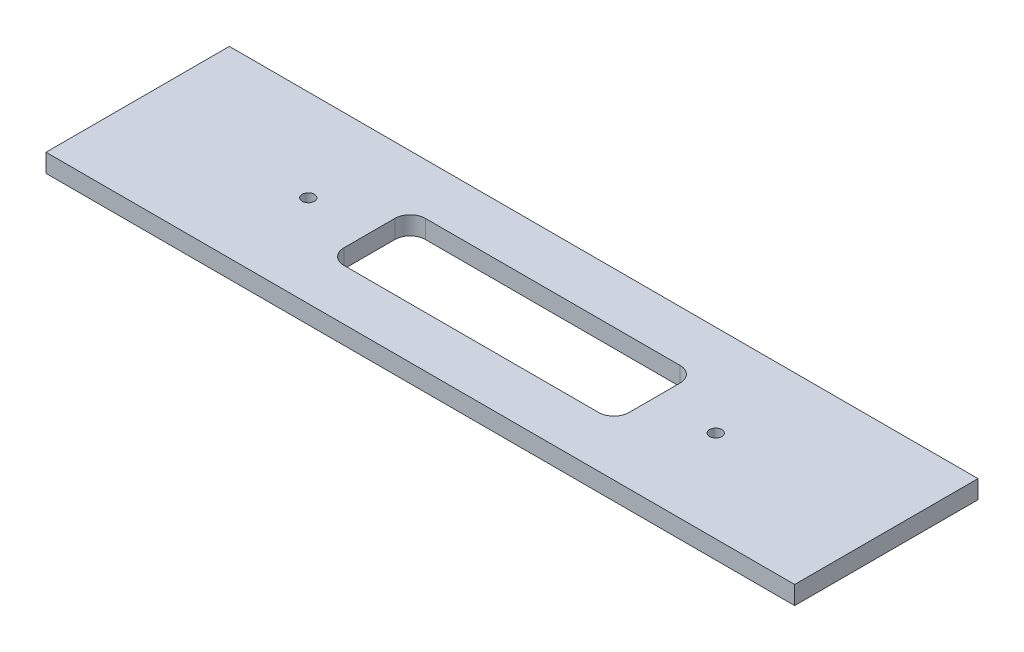
ISO-10303-21;
HEADER;
FILE_DESCRIPTION(('STEP AP214'),'2;1');
FILE_NAME('part.step','',(''),(''),'','','');
FILE_SCHEMA(('AUTOMOTIVE_DESIGN { 1 0 10303 214 1 1 1 1 }'));
ENDSEC;
DATA;
#1=APPLICATION_CONTEXT('core data for automotive mechanical design processes');
#2=APPLICATION_PROTOCOL_DEFINITION('international standard','automotive_design',2000,#1);
#3=PRODUCT_CONTEXT('',#1,'mechanical');
#4=PRODUCT('Part','Part','',(#3));
#5=PRODUCT_RELATED_PRODUCT_CATEGORY('part','',(#4));
#6=PRODUCT_DEFINITION_FORMATION('','',#4);
#7=PRODUCT_DEFINITION_CONTEXT('part definition',#1,'design');
#8=PRODUCT_DEFINITION('design','',#6,#7);
#9=PRODUCT_DEFINITION_SHAPE('','',#8);
#10=(LENGTH_UNIT() NAMED_UNIT(*) SI_UNIT(.MILLI.,.METRE.));
#11=(NAMED_UNIT(*) PLANE_ANGLE_UNIT() SI_UNIT($,.RADIAN.));
#12=(NAMED_UNIT(*) SI_UNIT($,.STERADIAN.) SOLID_ANGLE_UNIT());
#13=UNCERTAINTY_MEASURE_WITH_UNIT(LENGTH_MEASURE(1.E-05),#10,'distance_accuracy_value','');
#14=(GEOMETRIC_REPRESENTATION_CONTEXT(3) GLOBAL_UNCERTAINTY_ASSIGNED_CONTEXT((#13)) GLOBAL_UNIT_ASSIGNED_CONTEXT((#10,
#11,#12)) REPRESENTATION_CONTEXT('',''));
#15=CARTESIAN_POINT('',(0.,0.,0.));
#16=DIRECTION('',(0.,0.,1.));
#17=DIRECTION('',(1.,0.,0.));
#18=AXIS2_PLACEMENT_3D('',#15,#16,#17);
#19=CARTESIAN_POINT('',(367.5,18.,90.));
#20=DIRECTION('',(-1.,0.,0.));
#21=DIRECTION('',(0.,0.,1.));
#22=AXIS2_PLACEMENT_3D('',#19,#20,#21);
#23=PLANE('',#22);
#24=DIRECTION('',(0.,0.,-1.));
#25=VECTOR('',#24,1.);
#26=CARTESIAN_POINT('',(367.5,0.,90.));
#27=LINE('',#26,#25);
#28=CARTESIAN_POINT('',(367.5,0.,90.));
#29=VERTEX_POINT('',#28);
#30=CARTESIAN_POINT('',(367.5,0.,-90.));
#31=VERTEX_POINT('',#30);
#32=EDGE_CURVE('E185',#29,#31,#27,.T.);
#33=ORIENTED_EDGE('',*,*,#32,.T.);
#34=DIRECTION('',(0.,-1.,0.));
#35=VECTOR('',#34,1.);
#36=CARTESIAN_POINT('',(367.5,18.,-90.));
#37=LINE('',#36,#35);
#38=CARTESIAN_POINT('',(367.5,18.,-90.));
#39=VERTEX_POINT('',#38);
#40=EDGE_CURVE('E201',#39,#31,#37,.T.);
#41=ORIENTED_EDGE('',*,*,#40,.F.);
#42=DIRECTION('',(0.,0.,-1.));
#43=VECTOR('',#42,1.);
#44=CARTESIAN_POINT('',(367.5,18.,90.));
#45=LINE('',#44,#43);
#46=CARTESIAN_POINT('',(367.5,18.,90.));
#47=VERTEX_POINT('',#46);
#48=EDGE_CURVE('E174',#47,#39,#45,.T.);
#49=ORIENTED_EDGE('',*,*,#48,.F.);
#50=DIRECTION('',(0.,-1.,0.));
#51=VECTOR('',#50,1.);
#52=CARTESIAN_POINT('',(367.5,18.,90.));
#53=LINE('',#52,#51);
#54=EDGE_CURVE('E184',#47,#29,#53,.T.);
#55=ORIENTED_EDGE('',*,*,#54,.T.);
#56=EDGE_LOOP('',(#33,#41,#49,#55));
#57=FACE_BOUND('',#56,.T.);
#58=ADVANCED_FACE('F35',(#57),#23,.F.);
#59=CARTESIAN_POINT('',(-367.5,18.,-90.));
#60=DIRECTION('',(0.,0.,1.));
#61=DIRECTION('',(1.,0.,0.));
#62=AXIS2_PLACEMENT_3D('',#59,#60,#61);
#63=PLANE('',#62);
#64=DIRECTION('',(-1.,0.,0.));
#65=VECTOR('',#64,1.);
#66=CARTESIAN_POINT('',(-367.5,0.,-90.));
#67=LINE('',#66,#65);
#68=CARTESIAN_POINT('',(-367.5,0.,-90.));
#69=VERTEX_POINT('',#68);
#70=EDGE_CURVE('E188',#31,#69,#67,.T.);
#71=ORIENTED_EDGE('',*,*,#70,.T.);
#72=DIRECTION('',(0.,-1.,0.));
#73=VECTOR('',#72,1.);
#74=CARTESIAN_POINT('',(-367.5,18.,-90.));
#75=LINE('',#74,#73);
#76=CARTESIAN_POINT('',(-367.5,18.,-90.));
#77=VERTEX_POINT('',#76);
#78=EDGE_CURVE('E198',#77,#69,#75,.T.);
#79=ORIENTED_EDGE('',*,*,#78,.F.);
#80=DIRECTION('',(-1.,0.,0.));
#81=VECTOR('',#80,1.);
#82=CARTESIAN_POINT('',(-367.5,18.,-90.));
#83=LINE('',#82,#81);
#84=EDGE_CURVE('E177',#39,#77,#83,.T.);
#85=ORIENTED_EDGE('',*,*,#84,.F.);
#86=ORIENTED_EDGE('',*,*,#40,.T.);
#87=EDGE_LOOP('',(#71,#79,#85,#86));
#88=FACE_BOUND('',#87,.T.);
#89=ADVANCED_FACE('F249',(#88),#63,.F.);
#90=CARTESIAN_POINT('',(-367.5,18.,90.));
#91=DIRECTION('',(1.,0.,0.));
#92=DIRECTION('',(0.,0.,-1.));
#93=AXIS2_PLACEMENT_3D('',#90,#91,#92);
#94=PLANE('',#93);
#95=DIRECTION('',(0.,0.,1.));
#96=VECTOR('',#95,1.);
#97=CARTESIAN_POINT('',(-367.5,0.,90.));
#98=LINE('',#97,#96);
#99=CARTESIAN_POINT('',(-367.5,0.,90.));
#100=VERTEX_POINT('',#99);
#101=EDGE_CURVE('E190',#69,#100,#98,.T.);
#102=ORIENTED_EDGE('',*,*,#101,.T.);
#103=DIRECTION('',(0.,-1.,0.));
#104=VECTOR('',#103,1.);
#105=CARTESIAN_POINT('',(-367.5,18.,90.));
#106=LINE('',#105,#104);
#107=CARTESIAN_POINT('',(-367.5,18.,90.));
#108=VERTEX_POINT('',#107);
#109=EDGE_CURVE('E195',#108,#100,#106,.T.);
#110=ORIENTED_EDGE('',*,*,#109,.F.);
#111=DIRECTION('',(0.,0.,1.));
#112=VECTOR('',#111,1.);
#113=CARTESIAN_POINT('',(-367.5,18.,90.));
#114=LINE('',#113,#112);
#115=EDGE_CURVE('E180',#77,#108,#114,.T.);
#116=ORIENTED_EDGE('',*,*,#115,.F.);
#117=ORIENTED_EDGE('',*,*,#78,.T.);
#118=EDGE_LOOP('',(#102,#110,#116,#117));
#119=FACE_BOUND('',#118,.T.);
#120=ADVANCED_FACE('F246',(#119),#94,.F.);
#121=CARTESIAN_POINT('',(-367.5,18.,90.));
#122=DIRECTION('',(0.,0.,-1.));
#123=DIRECTION('',(-1.,0.,0.));
#124=AXIS2_PLACEMENT_3D('',#121,#122,#123);
#125=PLANE('',#124);
#126=DIRECTION('',(1.,0.,0.));
#127=VECTOR('',#126,1.);
#128=CARTESIAN_POINT('',(-367.5,0.,90.));
#129=LINE('',#128,#127);
#130=EDGE_CURVE('E178',#100,#29,#129,.T.);
#131=ORIENTED_EDGE('',*,*,#130,.T.);
#132=ORIENTED_EDGE('',*,*,#54,.F.);
#133=DIRECTION('',(1.,0.,0.));
#134=VECTOR('',#133,1.);
#135=CARTESIAN_POINT('',(-367.5,18.,90.));
#136=LINE('',#135,#134);
#137=EDGE_CURVE('E182',#108,#47,#136,.T.);
#138=ORIENTED_EDGE('',*,*,#137,.F.);
#139=ORIENTED_EDGE('',*,*,#109,.T.);
#140=EDGE_LOOP('',(#131,#132,#138,#139));
#141=FACE_BOUND('',#140,.T.);
#142=ADVANCED_FACE('F242',(#141),#125,.F.);
#143=CARTESIAN_POINT('',(0.,18.,0.));
#144=DIRECTION('',(0.,-1.,0.));
#145=DIRECTION('',(0.,0.,-1.));
#146=AXIS2_PLACEMENT_3D('',#143,#144,#145);
#147=PLANE('',#146);
#148=CARTESIAN_POINT('',(200.,18.,0.));
#149=DIRECTION('',(0.,1.,0.));
#150=DIRECTION('',(0.,0.,1.));
#151=AXIS2_PLACEMENT_3D('',#148,#149,#150);
#152=CIRCLE('',#151,6.00000000000004);
#153=CARTESIAN_POINT('',(200.,18.,6.00000000000004));
#154=VERTEX_POINT('',#153);
#155=EDGE_CURVE('E398',#154,#154,#152,.T.);
#156=ORIENTED_EDGE('',*,*,#155,.F.);
#157=EDGE_LOOP('',(#156));
#158=FACE_BOUND('',#157,.T.);
#159=CARTESIAN_POINT('',(-200.,18.,0.));
#160=DIRECTION('',(0.,1.,0.));
#161=DIRECTION('',(0.,0.,1.));
#162=AXIS2_PLACEMENT_3D('',#159,#160,#161);
#163=CIRCLE('',#162,6.00000000000002);
#164=CARTESIAN_POINT('',(-200.,18.,6.00000000000002));
#165=VERTEX_POINT('',#164);
#166=EDGE_CURVE('E397',#165,#165,#163,.T.);
#167=ORIENTED_EDGE('',*,*,#166,.F.);
#168=EDGE_LOOP('',(#167));
#169=FACE_BOUND('',#168,.T.);
#170=DIRECTION('',(1.,0.,0.));
#171=VECTOR('',#170,1.);
#172=CARTESIAN_POINT('',(-125.,18.,40.));
#173=LINE('',#172,#171);
#174=CARTESIAN_POINT('',(-125.,18.,40.));
#175=VERTEX_POINT('',#174);
#176=CARTESIAN_POINT('',(125.,18.,40.));
#177=VERTEX_POINT('',#176);
#178=EDGE_CURVE('E136',#175,#177,#173,.T.);
#179=ORIENTED_EDGE('',*,*,#178,.F.);
#180=CARTESIAN_POINT('',(-125.,18.,25.));
#181=DIRECTION('',(0.,1.,0.));
#182=DIRECTION('',(0.,0.,-1.));
#183=AXIS2_PLACEMENT_3D('',#180,#181,#182);
#184=CIRCLE('',#183,15.);
#185=CARTESIAN_POINT('',(-140.,18.,25.));
#186=VERTEX_POINT('',#185);
#187=EDGE_CURVE('E51',#186,#175,#184,.T.);
#188=ORIENTED_EDGE('',*,*,#187,.F.);
#189=DIRECTION('',(0.,0.,1.));
#190=VECTOR('',#189,1.);
#191=CARTESIAN_POINT('',(-140.,18.,25.));
#192=LINE('',#191,#190);
#193=CARTESIAN_POINT('',(-140.,18.,-25.));
#194=VERTEX_POINT('',#193);
#195=EDGE_CURVE('E158',#194,#186,#192,.T.);
#196=ORIENTED_EDGE('',*,*,#195,.F.);
#197=CARTESIAN_POINT('',(-125.,18.,-25.));
#198=DIRECTION('',(0.,1.,0.));
#199=DIRECTION('',(0.,0.,-1.));
#200=AXIS2_PLACEMENT_3D('',#197,#198,#199);
#201=CIRCLE('',#200,15.);
#202=CARTESIAN_POINT('',(-125.,18.,-40.));
#203=VERTEX_POINT('',#202);
#204=EDGE_CURVE('E155',#203,#194,#201,.T.);
#205=ORIENTED_EDGE('',*,*,#204,.F.);
#206=DIRECTION('',(-1.,0.,0.));
#207=VECTOR('',#206,1.);
#208=CARTESIAN_POINT('',(-125.,18.,-40.));
#209=LINE('',#208,#207);
#210=CARTESIAN_POINT('',(125.,18.,-40.));
#211=VERTEX_POINT('',#210);
#212=EDGE_CURVE('E152',#211,#203,#209,.T.);
#213=ORIENTED_EDGE('',*,*,#212,.F.);
#214=CARTESIAN_POINT('',(125.,18.,-25.));
#215=DIRECTION('',(0.,1.,0.));
#216=DIRECTION('',(0.,0.,-1.));
#217=AXIS2_PLACEMENT_3D('',#214,#215,#216);
#218=CIRCLE('',#217,15.);
#219=CARTESIAN_POINT('',(140.,18.,-25.));
#220=VERTEX_POINT('',#219);
#221=EDGE_CURVE('E146',#220,#211,#218,.T.);
#222=ORIENTED_EDGE('',*,*,#221,.F.);
#223=DIRECTION('',(0.,0.,-1.));
#224=VECTOR('',#223,1.);
#225=CARTESIAN_POINT('',(140.,18.,25.));
#226=LINE('',#225,#224);
#227=CARTESIAN_POINT('',(140.,18.,25.));
#228=VERTEX_POINT('',#227);
#229=EDGE_CURVE('E144',#228,#220,#226,.T.);
#230=ORIENTED_EDGE('',*,*,#229,.F.);
#231=CARTESIAN_POINT('',(125.,18.,25.));
#232=DIRECTION('',(0.,1.,0.));
#233=DIRECTION('',(0.,0.,1.));
#234=AXIS2_PLACEMENT_3D('',#231,#232,#233);
#235=CIRCLE('',#234,15.);
#236=EDGE_CURVE('E127',#177,#228,#235,.T.);
#237=ORIENTED_EDGE('',*,*,#236,.F.);
#238=EDGE_LOOP('',(#179,#188,#196,#205,#213,#222,#230,#237));
#239=FACE_BOUND('',#238,.T.);
#240=ORIENTED_EDGE('',*,*,#48,.T.);
#241=ORIENTED_EDGE('',*,*,#84,.T.);
#242=ORIENTED_EDGE('',*,*,#115,.T.);
#243=ORIENTED_EDGE('',*,*,#137,.T.);
#244=EDGE_LOOP('',(#240,#241,#242,#243));
#245=FACE_BOUND('',#244,.T.);
#246=ADVANCED_FACE('F140',(#158,#169,#239,#245),#147,.F.);
#247=CARTESIAN_POINT('',(0.,0.,0.));
#248=DIRECTION('',(0.,-1.,0.));
#249=DIRECTION('',(0.,0.,-1.));
#250=AXIS2_PLACEMENT_3D('',#247,#248,#249);
#251=PLANE('',#250);
#252=CARTESIAN_POINT('',(200.,0.,0.));
#253=DIRECTION('',(0.,-1.,0.));
#254=DIRECTION('',(0.,0.,-1.));
#255=AXIS2_PLACEMENT_3D('',#252,#253,#254);
#256=CIRCLE('',#255,6.00000000000004);
#257=CARTESIAN_POINT('',(200.,0.,-6.00000000000004));
#258=VERTEX_POINT('',#257);
#259=EDGE_CURVE('E38',#258,#258,#256,.T.);
#260=ORIENTED_EDGE('',*,*,#259,.F.);
#261=EDGE_LOOP('',(#260));
#262=FACE_BOUND('',#261,.T.);
#263=CARTESIAN_POINT('',(-200.,0.,0.));
#264=DIRECTION('',(0.,-1.,0.));
#265=DIRECTION('',(0.,0.,-1.));
#266=AXIS2_PLACEMENT_3D('',#263,#264,#265);
#267=CIRCLE('',#266,6.00000000000002);
#268=CARTESIAN_POINT('',(-200.,0.,-6.00000000000002));
#269=VERTEX_POINT('',#268);
#270=EDGE_CURVE('E163',#269,#269,#267,.T.);
#271=ORIENTED_EDGE('',*,*,#270,.F.);
#272=EDGE_LOOP('',(#271));
#273=FACE_BOUND('',#272,.T.);
#274=CARTESIAN_POINT('',(-125.,0.,25.));
#275=DIRECTION('',(0.,-1.,0.));
#276=DIRECTION('',(0.,0.,-1.));
#277=AXIS2_PLACEMENT_3D('',#274,#275,#276);
#278=CIRCLE('',#277,15.);
#279=CARTESIAN_POINT('',(-125.,0.,40.));
#280=VERTEX_POINT('',#279);
#281=CARTESIAN_POINT('',(-140.,0.,25.));
#282=VERTEX_POINT('',#281);
#283=EDGE_CURVE('E11',#280,#282,#278,.T.);
#284=ORIENTED_EDGE('',*,*,#283,.F.);
#285=DIRECTION('',(-1.,0.,0.));
#286=VECTOR('',#285,1.);
#287=CARTESIAN_POINT('',(0.,0.,40.));
#288=LINE('',#287,#286);
#289=CARTESIAN_POINT('',(125.,0.,40.));
#290=VERTEX_POINT('',#289);
#291=EDGE_CURVE('E204',#290,#280,#288,.T.);
#292=ORIENTED_EDGE('',*,*,#291,.F.);
#293=CARTESIAN_POINT('',(125.,0.,25.));
#294=DIRECTION('',(0.,-1.,0.));
#295=DIRECTION('',(0.,0.,-1.));
#296=AXIS2_PLACEMENT_3D('',#293,#294,#295);
#297=CIRCLE('',#296,15.);
#298=CARTESIAN_POINT('',(140.,0.,25.));
#299=VERTEX_POINT('',#298);
#300=EDGE_CURVE('E130',#299,#290,#297,.T.);
#301=ORIENTED_EDGE('',*,*,#300,.F.);
#302=DIRECTION('',(0.,0.,1.));
#303=VECTOR('',#302,1.);
#304=CARTESIAN_POINT('',(140.,0.,0.));
#305=LINE('',#304,#303);
#306=CARTESIAN_POINT('',(140.,0.,-25.));
#307=VERTEX_POINT('',#306);
#308=EDGE_CURVE('E207',#307,#299,#305,.T.);
#309=ORIENTED_EDGE('',*,*,#308,.F.);
#310=CARTESIAN_POINT('',(125.,0.,-25.));
#311=DIRECTION('',(0.,-1.,0.));
#312=DIRECTION('',(0.,0.,-1.));
#313=AXIS2_PLACEMENT_3D('',#310,#311,#312);
#314=CIRCLE('',#313,15.);
#315=CARTESIAN_POINT('',(125.,0.,-40.));
#316=VERTEX_POINT('',#315);
#317=EDGE_CURVE('E209',#316,#307,#314,.T.);
#318=ORIENTED_EDGE('',*,*,#317,.F.);
#319=DIRECTION('',(1.,0.,0.));
#320=VECTOR('',#319,1.);
#321=CARTESIAN_POINT('',(0.,0.,-40.));
#322=LINE('',#321,#320);
#323=CARTESIAN_POINT('',(-125.,0.,-40.));
#324=VERTEX_POINT('',#323);
#325=EDGE_CURVE('E211',#324,#316,#322,.T.);
#326=ORIENTED_EDGE('',*,*,#325,.F.);
#327=CARTESIAN_POINT('',(-125.,0.,-25.));
#328=DIRECTION('',(0.,-1.,0.));
#329=DIRECTION('',(0.,0.,-1.));
#330=AXIS2_PLACEMENT_3D('',#327,#328,#329);
#331=CIRCLE('',#330,15.);
#332=CARTESIAN_POINT('',(-140.,0.,-25.));
#333=VERTEX_POINT('',#332);
#334=EDGE_CURVE('E213',#333,#324,#331,.T.);
#335=ORIENTED_EDGE('',*,*,#334,.F.);
#336=DIRECTION('',(0.,0.,-1.));
#337=VECTOR('',#336,1.);
#338=CARTESIAN_POINT('',(-140.,0.,0.));
#339=LINE('',#338,#337);
#340=EDGE_CURVE('E43',#282,#333,#339,.T.);
#341=ORIENTED_EDGE('',*,*,#340,.F.);
#342=EDGE_LOOP('',(#284,#292,#301,#309,#318,#326,#335,#341));
#343=FACE_BOUND('',#342,.T.);
#344=ORIENTED_EDGE('',*,*,#32,.F.);
#345=ORIENTED_EDGE('',*,*,#130,.F.);
#346=ORIENTED_EDGE('',*,*,#101,.F.);
#347=ORIENTED_EDGE('',*,*,#70,.F.);
#348=EDGE_LOOP('',(#344,#345,#346,#347));
#349=FACE_BOUND('',#348,.T.);
#350=ADVANCED_FACE('F224',(#262,#273,#343,#349),#251,.T.);
#351=CARTESIAN_POINT('',(-125.,-42.,25.));
#352=DIRECTION('',(0.,1.,0.));
#353=DIRECTION('',(0.,0.,1.));
#354=AXIS2_PLACEMENT_3D('',#351,#352,#353);
#355=CYLINDRICAL_SURFACE('',#354,15.);
#356=ORIENTED_EDGE('',*,*,#283,.T.);
#357=DIRECTION('',(0.,1.,0.));
#358=VECTOR('',#357,1.);
#359=CARTESIAN_POINT('',(-140.,-42.,25.));
#360=LINE('',#359,#358);
#361=EDGE_CURVE('E161',#282,#186,#360,.T.);
#362=ORIENTED_EDGE('',*,*,#361,.T.);
#363=ORIENTED_EDGE('',*,*,#187,.T.);
#364=DIRECTION('',(0.,1.,0.));
#365=VECTOR('',#364,1.);
#366=CARTESIAN_POINT('',(-125.,-42.,40.));
#367=LINE('',#366,#365);
#368=EDGE_CURVE('E133',#280,#175,#367,.T.);
#369=ORIENTED_EDGE('',*,*,#368,.F.);
#370=EDGE_LOOP('',(#356,#362,#363,#369));
#371=FACE_BOUND('',#370,.T.);
#372=ADVANCED_FACE('F227',(#371),#355,.F.);
#373=CARTESIAN_POINT('',(-140.,-42.,25.));
#374=DIRECTION('',(-1.,0.,0.));
#375=DIRECTION('',(0.,0.,1.));
#376=AXIS2_PLACEMENT_3D('',#373,#374,#375);
#377=PLANE('',#376);
#378=ORIENTED_EDGE('',*,*,#340,.T.);
#379=DIRECTION('',(0.,1.,0.));
#380=VECTOR('',#379,1.);
#381=CARTESIAN_POINT('',(-140.,-42.,-25.));
#382=LINE('',#381,#380);
#383=EDGE_CURVE('E164',#333,#194,#382,.T.);
#384=ORIENTED_EDGE('',*,*,#383,.T.);
#385=ORIENTED_EDGE('',*,*,#195,.T.);
#386=ORIENTED_EDGE('',*,*,#361,.F.);
#387=EDGE_LOOP('',(#378,#384,#385,#386));
#388=FACE_BOUND('',#387,.T.);
#389=ADVANCED_FACE('F309',(#388),#377,.F.);
#390=CARTESIAN_POINT('',(-125.,-42.,-25.));
#391=DIRECTION('',(0.,1.,0.));
#392=DIRECTION('',(0.,0.,1.));
#393=AXIS2_PLACEMENT_3D('',#390,#391,#392);
#394=CYLINDRICAL_SURFACE('',#393,15.);
#395=ORIENTED_EDGE('',*,*,#334,.T.);
#396=DIRECTION('',(0.,1.,0.));
#397=VECTOR('',#396,1.);
#398=CARTESIAN_POINT('',(-125.,-42.,-40.));
#399=LINE('',#398,#397);
#400=EDGE_CURVE('E166',#324,#203,#399,.T.);
#401=ORIENTED_EDGE('',*,*,#400,.T.);
#402=ORIENTED_EDGE('',*,*,#204,.T.);
#403=ORIENTED_EDGE('',*,*,#383,.F.);
#404=EDGE_LOOP('',(#395,#401,#402,#403));
#405=FACE_BOUND('',#404,.T.);
#406=ADVANCED_FACE('F316',(#405),#394,.F.);
#407=CARTESIAN_POINT('',(-125.,-42.,-40.));
#408=DIRECTION('',(0.,0.,-1.));
#409=DIRECTION('',(-1.,0.,0.));
#410=AXIS2_PLACEMENT_3D('',#407,#408,#409);
#411=PLANE('',#410);
#412=ORIENTED_EDGE('',*,*,#325,.T.);
#413=DIRECTION('',(0.,1.,0.));
#414=VECTOR('',#413,1.);
#415=CARTESIAN_POINT('',(125.,-42.,-40.));
#416=LINE('',#415,#414);
#417=EDGE_CURVE('E168',#316,#211,#416,.T.);
#418=ORIENTED_EDGE('',*,*,#417,.T.);
#419=ORIENTED_EDGE('',*,*,#212,.T.);
#420=ORIENTED_EDGE('',*,*,#400,.F.);
#421=EDGE_LOOP('',(#412,#418,#419,#420));
#422=FACE_BOUND('',#421,.T.);
#423=ADVANCED_FACE('F325',(#422),#411,.F.);
#424=CARTESIAN_POINT('',(125.,-42.,-25.));
#425=DIRECTION('',(0.,1.,0.));
#426=DIRECTION('',(0.,0.,1.));
#427=AXIS2_PLACEMENT_3D('',#424,#425,#426);
#428=CYLINDRICAL_SURFACE('',#427,15.);
#429=ORIENTED_EDGE('',*,*,#317,.T.);
#430=DIRECTION('',(0.,1.,0.));
#431=VECTOR('',#430,1.);
#432=CARTESIAN_POINT('',(140.,-42.,-25.));
#433=LINE('',#432,#431);
#434=EDGE_CURVE('E170',#307,#220,#433,.T.);
#435=ORIENTED_EDGE('',*,*,#434,.T.);
#436=ORIENTED_EDGE('',*,*,#221,.T.);
#437=ORIENTED_EDGE('',*,*,#417,.F.);
#438=EDGE_LOOP('',(#429,#435,#436,#437));
#439=FACE_BOUND('',#438,.T.);
#440=ADVANCED_FACE('F334',(#439),#428,.F.);
#441=CARTESIAN_POINT('',(140.,-42.,25.));
#442=DIRECTION('',(1.,0.,0.));
#443=DIRECTION('',(0.,0.,-1.));
#444=AXIS2_PLACEMENT_3D('',#441,#442,#443);
#445=PLANE('',#444);
#446=ORIENTED_EDGE('',*,*,#308,.T.);
#447=DIRECTION('',(0.,1.,0.));
#448=VECTOR('',#447,1.);
#449=CARTESIAN_POINT('',(140.,-42.,25.));
#450=LINE('',#449,#448);
#451=EDGE_CURVE('E132',#299,#228,#450,.T.);
#452=ORIENTED_EDGE('',*,*,#451,.T.);
#453=ORIENTED_EDGE('',*,*,#229,.T.);
#454=ORIENTED_EDGE('',*,*,#434,.F.);
#455=EDGE_LOOP('',(#446,#452,#453,#454));
#456=FACE_BOUND('',#455,.T.);
#457=ADVANCED_FACE('F343',(#456),#445,.F.);
#458=CARTESIAN_POINT('',(125.,-42.,25.));
#459=DIRECTION('',(0.,1.,0.));
#460=DIRECTION('',(0.,0.,1.));
#461=AXIS2_PLACEMENT_3D('',#458,#459,#460);
#462=CYLINDRICAL_SURFACE('',#461,15.);
#463=ORIENTED_EDGE('',*,*,#300,.T.);
#464=DIRECTION('',(0.,1.,0.));
#465=VECTOR('',#464,1.);
#466=CARTESIAN_POINT('',(125.,-42.,40.));
#467=LINE('',#466,#465);
#468=EDGE_CURVE('E59',#290,#177,#467,.T.);
#469=ORIENTED_EDGE('',*,*,#468,.T.);
#470=ORIENTED_EDGE('',*,*,#236,.T.);
#471=ORIENTED_EDGE('',*,*,#451,.F.);
#472=EDGE_LOOP('',(#463,#469,#470,#471));
#473=FACE_BOUND('',#472,.T.);
#474=ADVANCED_FACE('F124',(#473),#462,.F.);
#475=CARTESIAN_POINT('',(-125.,-42.,40.));
#476=DIRECTION('',(0.,0.,1.));
#477=DIRECTION('',(1.,0.,0.));
#478=AXIS2_PLACEMENT_3D('',#475,#476,#477);
#479=PLANE('',#478);
#480=ORIENTED_EDGE('',*,*,#291,.T.);
#481=ORIENTED_EDGE('',*,*,#368,.T.);
#482=ORIENTED_EDGE('',*,*,#178,.T.);
#483=ORIENTED_EDGE('',*,*,#468,.F.);
#484=EDGE_LOOP('',(#480,#481,#482,#483));
#485=FACE_BOUND('',#484,.T.);
#486=ADVANCED_FACE('F137',(#485),#479,.F.);
#487=CARTESIAN_POINT('',(-200.,-42.,0.));
#488=DIRECTION('',(0.,1.,0.));
#489=DIRECTION('',(0.,0.,1.));
#490=AXIS2_PLACEMENT_3D('',#487,#488,#489);
#491=CYLINDRICAL_SURFACE('',#490,6.00000000000002);
#492=ORIENTED_EDGE('',*,*,#270,.T.);
#493=EDGE_LOOP('',(#492));
#494=FACE_BOUND('',#493,.T.);
#495=ORIENTED_EDGE('',*,*,#166,.T.);
#496=EDGE_LOOP('',(#495));
#497=FACE_BOUND('',#496,.T.);
#498=ADVANCED_FACE('F367',(#494,#497),#491,.F.);
#499=CARTESIAN_POINT('',(200.,-42.,0.));
#500=DIRECTION('',(0.,1.,0.));
#501=DIRECTION('',(0.,0.,1.));
#502=AXIS2_PLACEMENT_3D('',#499,#500,#501);
#503=CYLINDRICAL_SURFACE('',#502,6.00000000000004);
#504=ORIENTED_EDGE('',*,*,#259,.T.);
#505=EDGE_LOOP('',(#504));
#506=FACE_BOUND('',#505,.T.);
#507=ORIENTED_EDGE('',*,*,#155,.T.);
#508=EDGE_LOOP('',(#507));
#509=FACE_BOUND('',#508,.T.);
#510=ADVANCED_FACE('F221',(#506,#509),#503,.F.);
#511=CLOSED_SHELL('',(#58,#89,#120,#142,#246,#350,#372,#389,#406,#423,#440,#457,#474,#486,#498,#510));
#512=MANIFOLD_SOLID_BREP('B2',#511);
#513=ADVANCED_BREP_SHAPE_REPRESENTATION('',(#18,#512),#14);
#514=SHAPE_DEFINITION_REPRESENTATION(#9,#513);
ENDSEC;
END-ISO-10303-21;
